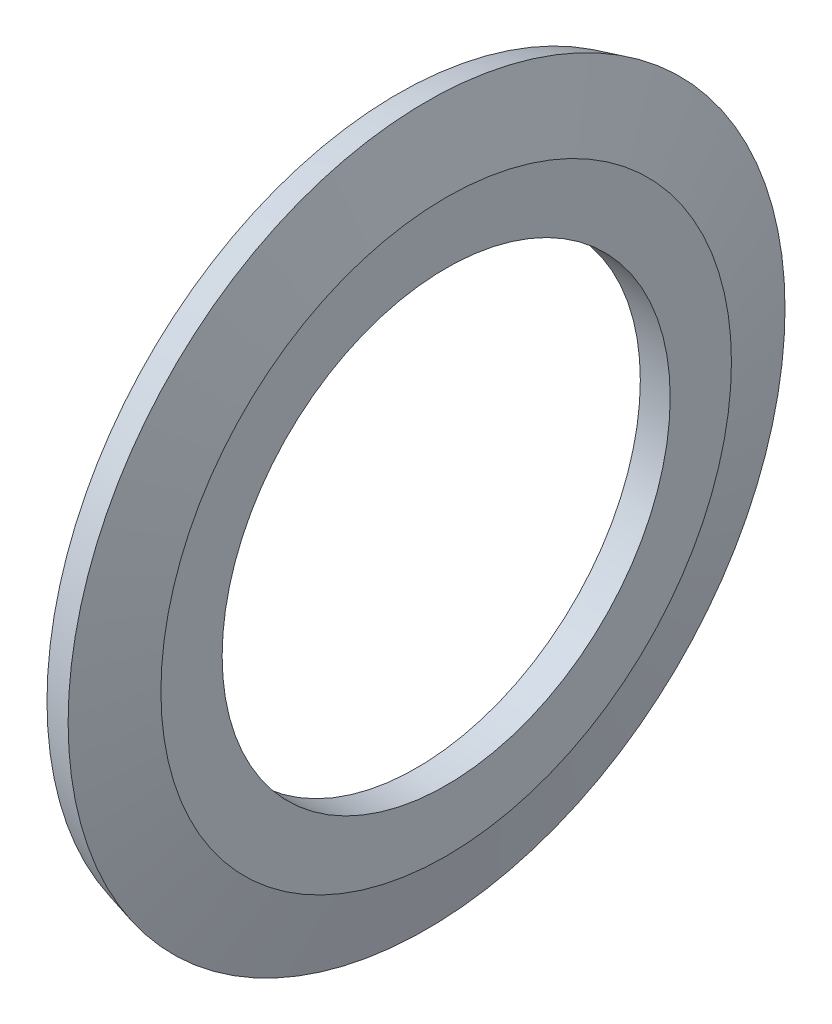
ISO-10303-21;
HEADER;
FILE_DESCRIPTION(('STEP AP214'),'2;1');
FILE_NAME('part.step','',(''),(''),'','','');
FILE_SCHEMA(('AUTOMOTIVE_DESIGN { 1 0 10303 214 1 1 1 1 }'));
ENDSEC;
DATA;
#1=APPLICATION_CONTEXT('core data for automotive mechanical design processes');
#2=APPLICATION_PROTOCOL_DEFINITION('international standard','automotive_design',2000,#1);
#3=PRODUCT_CONTEXT('',#1,'mechanical');
#4=PRODUCT('Part','Part','',(#3));
#5=PRODUCT_RELATED_PRODUCT_CATEGORY('part','',(#4));
#6=PRODUCT_DEFINITION_FORMATION('','',#4);
#7=PRODUCT_DEFINITION_CONTEXT('part definition',#1,'design');
#8=PRODUCT_DEFINITION('design','',#6,#7);
#9=PRODUCT_DEFINITION_SHAPE('','',#8);
#10=(LENGTH_UNIT() NAMED_UNIT(*) SI_UNIT(.MILLI.,.METRE.));
#11=(NAMED_UNIT(*) PLANE_ANGLE_UNIT() SI_UNIT($,.RADIAN.));
#12=(NAMED_UNIT(*) SI_UNIT($,.STERADIAN.) SOLID_ANGLE_UNIT());
#13=UNCERTAINTY_MEASURE_WITH_UNIT(LENGTH_MEASURE(1.E-05),#10,'distance_accuracy_value','');
#14=(GEOMETRIC_REPRESENTATION_CONTEXT(3) GLOBAL_UNCERTAINTY_ASSIGNED_CONTEXT((#13)) GLOBAL_UNIT_ASSIGNED_CONTEXT((#10,
#11,#12)) REPRESENTATION_CONTEXT('',''));
#15=CARTESIAN_POINT('',(0.,0.,0.));
#16=DIRECTION('',(0.,0.,1.));
#17=DIRECTION('',(1.,0.,0.));
#18=AXIS2_PLACEMENT_3D('',#15,#16,#17);
#19=CARTESIAN_POINT('',(0.,0.,0.));
#20=DIRECTION('',(-1.,0.,0.));
#21=DIRECTION('',(0.,0.,1.));
#22=AXIS2_PLACEMENT_3D('',#19,#20,#21);
#23=CYLINDRICAL_SURFACE('',#22,7.5);
#24=CARTESIAN_POINT('',(0.999999999999999,0.,0.));
#25=DIRECTION('',(-1.,0.,0.));
#26=DIRECTION('',(0.,0.,1.));
#27=AXIS2_PLACEMENT_3D('',#24,#25,#26);
#28=CIRCLE('',#27,7.5);
#29=CARTESIAN_POINT('',(0.999999999999999,0.,7.5));
#30=VERTEX_POINT('',#29);
#31=EDGE_CURVE('E10',#30,#30,#28,.T.);
#32=ORIENTED_EDGE('',*,*,#31,.F.);
#33=EDGE_LOOP('',(#32));
#34=FACE_BOUND('',#33,.T.);
#35=CARTESIAN_POINT('',(0.,0.,0.));
#36=DIRECTION('',(-1.,0.,0.));
#37=DIRECTION('',(0.,0.,1.));
#38=AXIS2_PLACEMENT_3D('',#35,#36,#37);
#39=CIRCLE('',#38,7.5);
#40=CARTESIAN_POINT('',(0.,0.,7.5));
#41=VERTEX_POINT('',#40);
#42=EDGE_CURVE('E53',#41,#41,#39,.T.);
#43=ORIENTED_EDGE('',*,*,#42,.T.);
#44=EDGE_LOOP('',(#43));
#45=FACE_BOUND('',#44,.T.);
#46=ADVANCED_FACE('F31',(#34,#45),#23,.F.);
#47=CARTESIAN_POINT('',(0.999999999999997,7.5,0.));
#48=DIRECTION('',(-1.,0.,0.));
#49=DIRECTION('',(0.,0.,1.));
#50=AXIS2_PLACEMENT_3D('',#47,#48,#49);
#51=PLANE('',#50);
#52=CARTESIAN_POINT('',(0.999999999999995,0.,0.));
#53=DIRECTION('',(-1.,0.,0.));
#54=DIRECTION('',(0.,0.,1.));
#55=AXIS2_PLACEMENT_3D('',#52,#53,#54);
#56=CIRCLE('',#55,9.55);
#57=CARTESIAN_POINT('',(0.999999999999995,0.,9.55));
#58=VERTEX_POINT('',#57);
#59=EDGE_CURVE('E37',#58,#58,#56,.T.);
#60=ORIENTED_EDGE('',*,*,#59,.F.);
#61=EDGE_LOOP('',(#60));
#62=FACE_BOUND('',#61,.T.);
#63=ORIENTED_EDGE('',*,*,#31,.T.);
#64=EDGE_LOOP('',(#63));
#65=FACE_BOUND('',#64,.T.);
#66=ADVANCED_FACE('F78',(#62,#65),#51,.F.);
#67=CARTESIAN_POINT('',(0.999999999999995,0.,0.));
#68=DIRECTION('',(-1.,0.,0.));
#69=DIRECTION('',(0.,0.,1.));
#70=AXIS2_PLACEMENT_3D('',#67,#68,#69);
#71=CONICAL_SURFACE('',#70,9.55,1.30899693899575);
#72=CARTESIAN_POINT('',(0.343524478543742,0.,0.));
#73=DIRECTION('',(-1.,0.,0.));
#74=DIRECTION('',(0.,0.,1.));
#75=AXIS2_PLACEMENT_3D('',#72,#73,#74);
#76=CIRCLE('',#75,12.);
#77=CARTESIAN_POINT('',(0.343524478543742,0.,12.));
#78=VERTEX_POINT('',#77);
#79=EDGE_CURVE('E41',#78,#78,#76,.T.);
#80=ORIENTED_EDGE('',*,*,#79,.F.);
#81=EDGE_LOOP('',(#80));
#82=FACE_BOUND('',#81,.T.);
#83=ORIENTED_EDGE('',*,*,#59,.T.);
#84=EDGE_LOOP('',(#83));
#85=FACE_BOUND('',#84,.T.);
#86=ADVANCED_FACE('F73',(#82,#85),#71,.T.);
#87=CARTESIAN_POINT('',(0.343524478543742,0.,0.));
#88=DIRECTION('',(1.,0.,0.));
#89=DIRECTION('',(0.,0.,-1.));
#90=AXIS2_PLACEMENT_3D('',#87,#88,#89);
#91=CONICAL_SURFACE('',#90,12.,0.261799387799153);
#92=CARTESIAN_POINT('',(-0.622401347745326,0.,0.));
#93=DIRECTION('',(-1.,0.,0.));
#94=DIRECTION('',(0.,0.,1.));
#95=AXIS2_PLACEMENT_3D('',#92,#93,#94);
#96=CIRCLE('',#95,11.7411809548975);
#97=CARTESIAN_POINT('',(-0.622401347745326,0.,11.7411809548975));
#98=VERTEX_POINT('',#97);
#99=EDGE_CURVE('E45',#98,#98,#96,.T.);
#100=ORIENTED_EDGE('',*,*,#99,.F.);
#101=EDGE_LOOP('',(#100));
#102=FACE_BOUND('',#101,.T.);
#103=ORIENTED_EDGE('',*,*,#79,.T.);
#104=EDGE_LOOP('',(#103));
#105=FACE_BOUND('',#104,.T.);
#106=ADVANCED_FACE('F67',(#102,#105),#91,.T.);
#107=CARTESIAN_POINT('',(-0.622401347745326,0.,0.));
#108=DIRECTION('',(-1.,0.,0.));
#109=DIRECTION('',(0.,0.,1.));
#110=AXIS2_PLACEMENT_3D('',#107,#108,#109);
#111=CONICAL_SURFACE('',#110,11.7411809548975,1.30899693899575);
#112=CARTESIAN_POINT('',(0.,0.,0.));
#113=DIRECTION('',(-1.,0.,0.));
#114=DIRECTION('',(0.,0.,1.));
#115=AXIS2_PLACEMENT_3D('',#112,#113,#114);
#116=CIRCLE('',#115,9.41834750241259);
#117=CARTESIAN_POINT('',(0.,0.,9.41834750241259));
#118=VERTEX_POINT('',#117);
#119=EDGE_CURVE('E50',#118,#118,#116,.T.);
#120=ORIENTED_EDGE('',*,*,#119,.F.);
#121=EDGE_LOOP('',(#120));
#122=FACE_BOUND('',#121,.T.);
#123=ORIENTED_EDGE('',*,*,#99,.T.);
#124=EDGE_LOOP('',(#123));
#125=FACE_BOUND('',#124,.T.);
#126=ADVANCED_FACE('F61',(#122,#125),#111,.F.);
#127=CARTESIAN_POINT('',(0.,7.5,0.));
#128=DIRECTION('',(1.,0.,0.));
#129=DIRECTION('',(0.,0.,-1.));
#130=AXIS2_PLACEMENT_3D('',#127,#128,#129);
#131=PLANE('',#130);
#132=ORIENTED_EDGE('',*,*,#42,.F.);
#133=EDGE_LOOP('',(#132));
#134=FACE_BOUND('',#133,.T.);
#135=ORIENTED_EDGE('',*,*,#119,.T.);
#136=EDGE_LOOP('',(#135));
#137=FACE_BOUND('',#136,.T.);
#138=ADVANCED_FACE('F58',(#134,#137),#131,.F.);
#139=CLOSED_SHELL('',(#46,#66,#86,#106,#126,#138));
#140=MANIFOLD_SOLID_BREP('B2',#139);
#141=ADVANCED_BREP_SHAPE_REPRESENTATION('',(#18,#140),#14);
#142=SHAPE_DEFINITION_REPRESENTATION(#9,#141);
ENDSEC;
END-ISO-10303-21;
